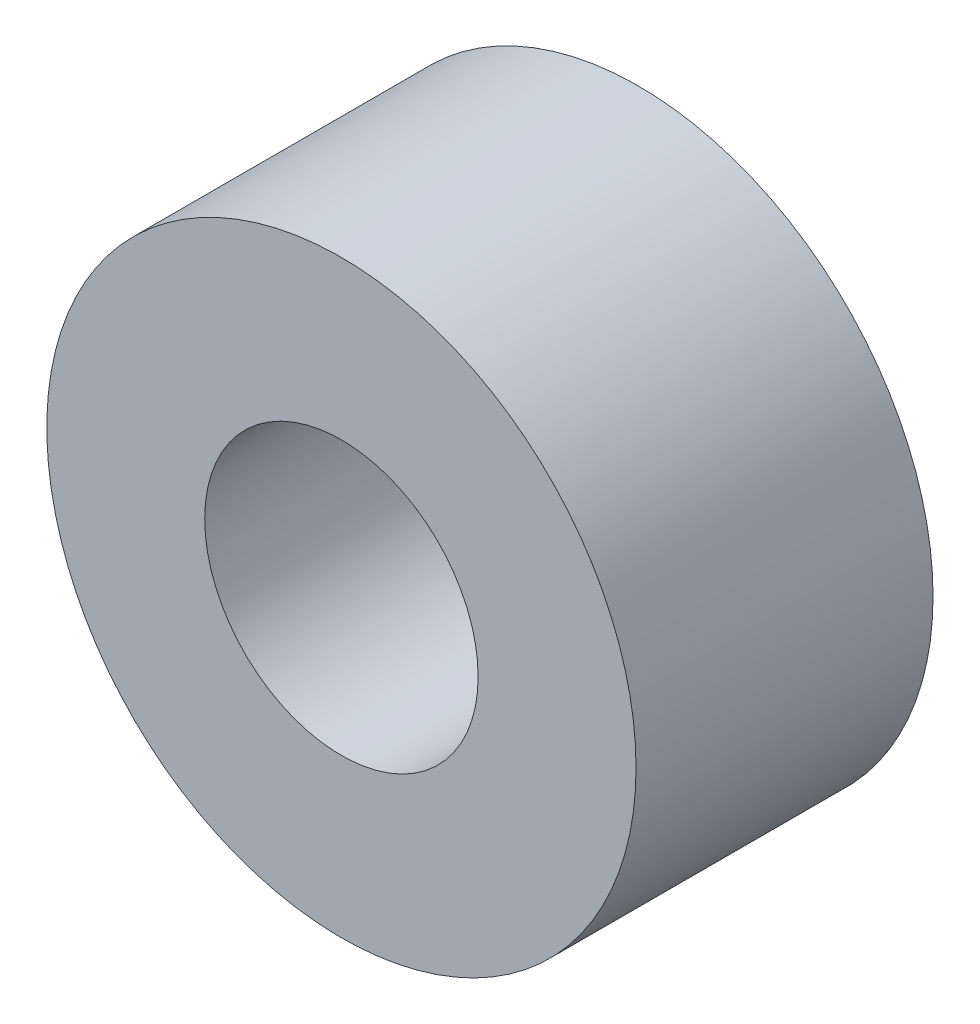
ISO-10303-21;
HEADER;
FILE_DESCRIPTION(('STEP AP214'),'2;1');
FILE_NAME('part.step','',(''),(''),'','','');
FILE_SCHEMA(('AUTOMOTIVE_DESIGN { 1 0 10303 214 1 1 1 1 }'));
ENDSEC;
DATA;
#1=APPLICATION_CONTEXT('core data for automotive mechanical design processes');
#2=APPLICATION_PROTOCOL_DEFINITION('international standard','automotive_design',2000,#1);
#3=PRODUCT_CONTEXT('',#1,'mechanical');
#4=PRODUCT('Part','Part','',(#3));
#5=PRODUCT_RELATED_PRODUCT_CATEGORY('part','',(#4));
#6=PRODUCT_DEFINITION_FORMATION('','',#4);
#7=PRODUCT_DEFINITION_CONTEXT('part definition',#1,'design');
#8=PRODUCT_DEFINITION('design','',#6,#7);
#9=PRODUCT_DEFINITION_SHAPE('','',#8);
#10=(LENGTH_UNIT() NAMED_UNIT(*) SI_UNIT(.MILLI.,.METRE.));
#11=(NAMED_UNIT(*) PLANE_ANGLE_UNIT() SI_UNIT($,.RADIAN.));
#12=(NAMED_UNIT(*) SI_UNIT($,.STERADIAN.) SOLID_ANGLE_UNIT());
#13=UNCERTAINTY_MEASURE_WITH_UNIT(LENGTH_MEASURE(1.E-05),#10,'distance_accuracy_value','');
#14=(GEOMETRIC_REPRESENTATION_CONTEXT(3) GLOBAL_UNCERTAINTY_ASSIGNED_CONTEXT((#13)) GLOBAL_UNIT_ASSIGNED_CONTEXT((#10,
#11,#12)) REPRESENTATION_CONTEXT('',''));
#15=CARTESIAN_POINT('',(0.,0.,0.));
#16=DIRECTION('',(0.,0.,1.));
#17=DIRECTION('',(1.,0.,0.));
#18=AXIS2_PLACEMENT_3D('',#15,#16,#17);
#19=CARTESIAN_POINT('',(0.,0.,3.2004));
#20=DIRECTION('',(0.,0.,1.));
#21=DIRECTION('',(1.,0.,0.));
#22=AXIS2_PLACEMENT_3D('',#19,#20,#21);
#23=PLANE('',#22);
#24=CARTESIAN_POINT('',(0.,0.,3.2004));
#25=DIRECTION('',(0.,0.,1.));
#26=DIRECTION('',(1.,0.,0.));
#27=AXIS2_PLACEMENT_3D('',#24,#25,#26);
#28=CIRCLE('',#27,3.175);
#29=CARTESIAN_POINT('',(3.175,0.,3.2004));
#30=VERTEX_POINT('',#29);
#31=EDGE_CURVE('E10',#30,#30,#28,.T.);
#32=ORIENTED_EDGE('',*,*,#31,.T.);
#33=EDGE_LOOP('',(#32));
#34=FACE_BOUND('',#33,.T.);
#35=CARTESIAN_POINT('',(0.,0.,3.2004));
#36=DIRECTION('',(0.,0.,1.));
#37=DIRECTION('',(1.,0.,0.));
#38=AXIS2_PLACEMENT_3D('',#35,#36,#37);
#39=CIRCLE('',#38,1.4732);
#40=CARTESIAN_POINT('',(1.4732,0.,3.2004));
#41=VERTEX_POINT('',#40);
#42=EDGE_CURVE('E42',#41,#41,#39,.T.);
#43=ORIENTED_EDGE('',*,*,#42,.F.);
#44=EDGE_LOOP('',(#43));
#45=FACE_BOUND('',#44,.T.);
#46=ADVANCED_FACE('F31',(#34,#45),#23,.T.);
#47=CARTESIAN_POINT('',(0.,0.,0.));
#48=DIRECTION('',(0.,0.,1.));
#49=DIRECTION('',(1.,0.,0.));
#50=AXIS2_PLACEMENT_3D('',#47,#48,#49);
#51=PLANE('',#50);
#52=CARTESIAN_POINT('',(0.,0.,0.));
#53=DIRECTION('',(0.,0.,1.));
#54=DIRECTION('',(1.,0.,0.));
#55=AXIS2_PLACEMENT_3D('',#52,#53,#54);
#56=CIRCLE('',#55,3.175);
#57=CARTESIAN_POINT('',(3.175,0.,0.));
#58=VERTEX_POINT('',#57);
#59=EDGE_CURVE('E35',#58,#58,#56,.T.);
#60=ORIENTED_EDGE('',*,*,#59,.F.);
#61=EDGE_LOOP('',(#60));
#62=FACE_BOUND('',#61,.T.);
#63=CARTESIAN_POINT('',(0.,0.,0.));
#64=DIRECTION('',(0.,0.,1.));
#65=DIRECTION('',(1.,0.,0.));
#66=AXIS2_PLACEMENT_3D('',#63,#64,#65);
#67=CIRCLE('',#66,1.4732);
#68=CARTESIAN_POINT('',(1.4732,0.,0.));
#69=VERTEX_POINT('',#68);
#70=EDGE_CURVE('E44',#69,#69,#67,.T.);
#71=ORIENTED_EDGE('',*,*,#70,.T.);
#72=EDGE_LOOP('',(#71));
#73=FACE_BOUND('',#72,.T.);
#74=ADVANCED_FACE('F54',(#62,#73),#51,.F.);
#75=CARTESIAN_POINT('',(0.,0.,3.2004));
#76=DIRECTION('',(0.,0.,-1.));
#77=DIRECTION('',(-1.,0.,0.));
#78=AXIS2_PLACEMENT_3D('',#75,#76,#77);
#79=CYLINDRICAL_SURFACE('',#78,3.175);
#80=ORIENTED_EDGE('',*,*,#31,.F.);
#81=EDGE_LOOP('',(#80));
#82=FACE_BOUND('',#81,.T.);
#83=ORIENTED_EDGE('',*,*,#59,.T.);
#84=EDGE_LOOP('',(#83));
#85=FACE_BOUND('',#84,.T.);
#86=ADVANCED_FACE('F33',(#82,#85),#79,.T.);
#87=CARTESIAN_POINT('',(0.,0.,3.2004));
#88=DIRECTION('',(0.,0.,-1.));
#89=DIRECTION('',(-1.,0.,0.));
#90=AXIS2_PLACEMENT_3D('',#87,#88,#89);
#91=CYLINDRICAL_SURFACE('',#90,1.4732);
#92=ORIENTED_EDGE('',*,*,#42,.T.);
#93=EDGE_LOOP('',(#92));
#94=FACE_BOUND('',#93,.T.);
#95=ORIENTED_EDGE('',*,*,#70,.F.);
#96=EDGE_LOOP('',(#95));
#97=FACE_BOUND('',#96,.T.);
#98=ADVANCED_FACE('F50',(#94,#97),#91,.F.);
#99=CLOSED_SHELL('',(#46,#74,#86,#98));
#100=MANIFOLD_SOLID_BREP('B2',#99);
#101=ADVANCED_BREP_SHAPE_REPRESENTATION('',(#18,#100),#14);
#102=SHAPE_DEFINITION_REPRESENTATION(#9,#101);
ENDSEC;
END-ISO-10303-21;
